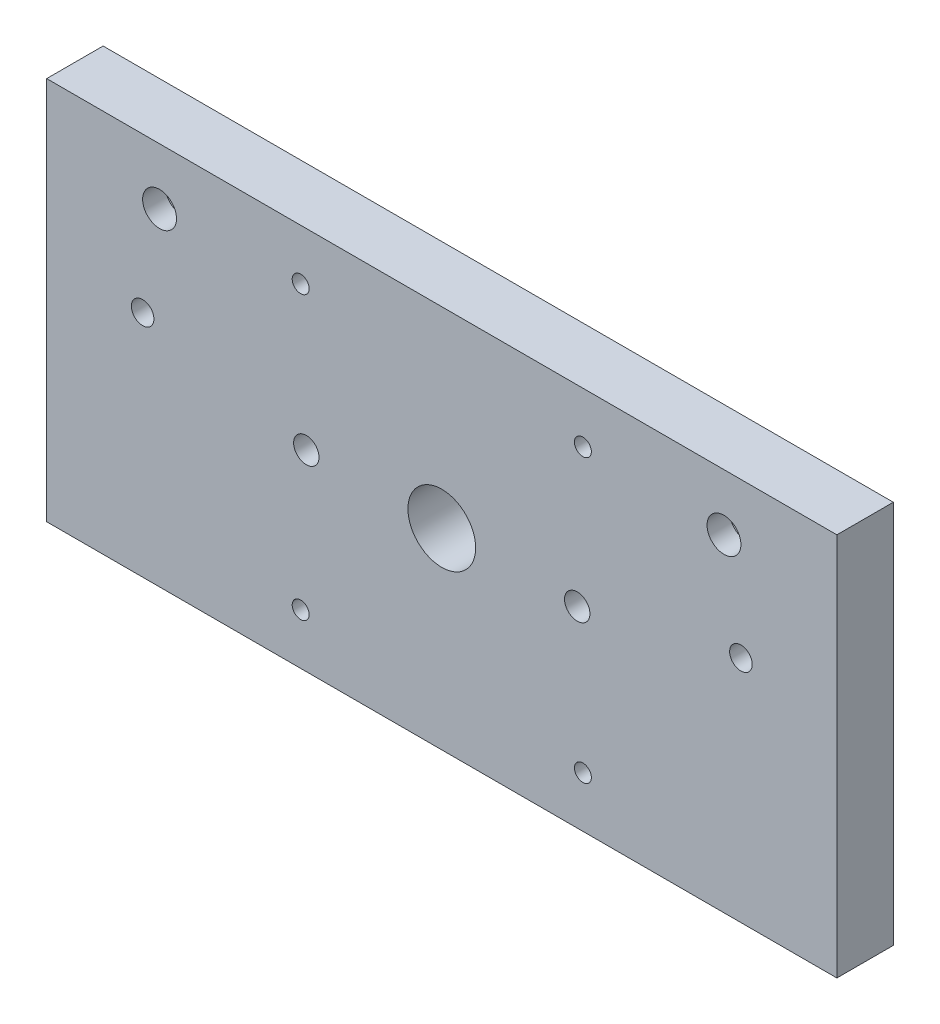
ISO-10303-21;
HEADER;
FILE_DESCRIPTION(('STEP AP214'),'2;1');
FILE_NAME('part.step','',(''),(''),'','','');
FILE_SCHEMA(('AUTOMOTIVE_DESIGN { 1 0 10303 214 1 1 1 1 }'));
ENDSEC;
DATA;
#1=APPLICATION_CONTEXT('core data for automotive mechanical design processes');
#2=APPLICATION_PROTOCOL_DEFINITION('international standard','automotive_design',2000,#1);
#3=PRODUCT_CONTEXT('',#1,'mechanical');
#4=PRODUCT('Part','Part','',(#3));
#5=PRODUCT_RELATED_PRODUCT_CATEGORY('part','',(#4));
#6=PRODUCT_DEFINITION_FORMATION('','',#4);
#7=PRODUCT_DEFINITION_CONTEXT('part definition',#1,'design');
#8=PRODUCT_DEFINITION('design','',#6,#7);
#9=PRODUCT_DEFINITION_SHAPE('','',#8);
#10=(LENGTH_UNIT() NAMED_UNIT(*) SI_UNIT(.MILLI.,.METRE.));
#11=(NAMED_UNIT(*) PLANE_ANGLE_UNIT() SI_UNIT($,.RADIAN.));
#12=(NAMED_UNIT(*) SI_UNIT($,.STERADIAN.) SOLID_ANGLE_UNIT());
#13=UNCERTAINTY_MEASURE_WITH_UNIT(LENGTH_MEASURE(1.E-05),#10,'distance_accuracy_value','');
#14=(GEOMETRIC_REPRESENTATION_CONTEXT(3) GLOBAL_UNCERTAINTY_ASSIGNED_CONTEXT((#13)) GLOBAL_UNIT_ASSIGNED_CONTEXT((#10,
#11,#12)) REPRESENTATION_CONTEXT('',''));
#15=CARTESIAN_POINT('',(0.,0.,0.));
#16=DIRECTION('',(0.,0.,1.));
#17=DIRECTION('',(1.,0.,0.));
#18=AXIS2_PLACEMENT_3D('',#15,#16,#17);
#19=CARTESIAN_POINT('',(17.,40.6,10.));
#20=DIRECTION('',(0.,0.,-1.));
#21=DIRECTION('',(-1.,0.,0.));
#22=AXIS2_PLACEMENT_3D('',#19,#20,#21);
#23=CYLINDRICAL_SURFACE('',#22,2.);
#24=CARTESIAN_POINT('',(17.,40.6,10.));
#25=DIRECTION('',(0.,0.,1.));
#26=DIRECTION('',(1.,0.,0.));
#27=AXIS2_PLACEMENT_3D('',#24,#25,#26);
#28=CIRCLE('',#27,2.);
#29=CARTESIAN_POINT('',(19.,40.6,10.));
#30=VERTEX_POINT('',#29);
#31=EDGE_CURVE('E171',#30,#30,#28,.T.);
#32=ORIENTED_EDGE('',*,*,#31,.T.);
#33=EDGE_LOOP('',(#32));
#34=FACE_BOUND('',#33,.T.);
#35=CARTESIAN_POINT('',(17.,40.6,4.));
#36=DIRECTION('',(0.,0.,-1.));
#37=DIRECTION('',(-1.,0.,0.));
#38=AXIS2_PLACEMENT_3D('',#35,#36,#37);
#39=CIRCLE('',#38,2.);
#40=CARTESIAN_POINT('',(15.,40.6,4.));
#41=VERTEX_POINT('',#40);
#42=EDGE_CURVE('E33',#41,#41,#39,.T.);
#43=ORIENTED_EDGE('',*,*,#42,.T.);
#44=EDGE_LOOP('',(#43));
#45=FACE_BOUND('',#44,.T.);
#46=ADVANCED_FACE('F29',(#34,#45),#23,.F.);
#47=CARTESIAN_POINT('',(123.,40.6,10.));
#48=DIRECTION('',(0.,0.,-1.));
#49=DIRECTION('',(-1.,0.,0.));
#50=AXIS2_PLACEMENT_3D('',#47,#48,#49);
#51=CYLINDRICAL_SURFACE('',#50,1.99999999999998);
#52=CARTESIAN_POINT('',(123.,40.6,10.));
#53=DIRECTION('',(0.,0.,1.));
#54=DIRECTION('',(1.,0.,0.));
#55=AXIS2_PLACEMENT_3D('',#52,#53,#54);
#56=CIRCLE('',#55,1.99999999999998);
#57=CARTESIAN_POINT('',(125.,40.6,10.));
#58=VERTEX_POINT('',#57);
#59=EDGE_CURVE('E174',#58,#58,#56,.T.);
#60=ORIENTED_EDGE('',*,*,#59,.T.);
#61=EDGE_LOOP('',(#60));
#62=FACE_BOUND('',#61,.T.);
#63=CARTESIAN_POINT('',(123.,40.6,4.));
#64=DIRECTION('',(0.,0.,-1.));
#65=DIRECTION('',(-1.,0.,0.));
#66=AXIS2_PLACEMENT_3D('',#63,#64,#65);
#67=CIRCLE('',#66,1.99999999999998);
#68=CARTESIAN_POINT('',(121.,40.6,4.));
#69=VERTEX_POINT('',#68);
#70=EDGE_CURVE('E119',#69,#69,#67,.T.);
#71=ORIENTED_EDGE('',*,*,#70,.T.);
#72=EDGE_LOOP('',(#71));
#73=FACE_BOUND('',#72,.T.);
#74=ADVANCED_FACE('F210',(#62,#73),#51,.F.);
#75=CARTESIAN_POINT('',(20.,58.,10.));
#76=DIRECTION('',(0.,0.,-1.));
#77=DIRECTION('',(-1.,0.,0.));
#78=AXIS2_PLACEMENT_3D('',#75,#76,#77);
#79=CYLINDRICAL_SURFACE('',#78,3.);
#80=CARTESIAN_POINT('',(20.,58.,10.));
#81=DIRECTION('',(0.,0.,-1.));
#82=DIRECTION('',(-1.,0.,0.));
#83=AXIS2_PLACEMENT_3D('',#80,#81,#82);
#84=CIRCLE('',#83,3.);
#85=CARTESIAN_POINT('',(17.,58.,10.));
#86=VERTEX_POINT('',#85);
#87=EDGE_CURVE('E159',#86,#86,#84,.T.);
#88=ORIENTED_EDGE('',*,*,#87,.F.);
#89=EDGE_LOOP('',(#88));
#90=FACE_BOUND('',#89,.T.);
#91=CARTESIAN_POINT('',(20.,58.,6.));
#92=DIRECTION('',(0.,0.,-1.));
#93=DIRECTION('',(-1.,0.,0.));
#94=AXIS2_PLACEMENT_3D('',#91,#92,#93);
#95=CIRCLE('',#94,3.);
#96=CARTESIAN_POINT('',(17.,58.,6.));
#97=VERTEX_POINT('',#96);
#98=EDGE_CURVE('E115',#97,#97,#95,.F.);
#99=ORIENTED_EDGE('',*,*,#98,.F.);
#100=EDGE_LOOP('',(#99));
#101=FACE_BOUND('',#100,.T.);
#102=ADVANCED_FACE('F217',(#90,#101),#79,.F.);
#103=CARTESIAN_POINT('',(120.,58.,10.));
#104=DIRECTION('',(0.,0.,-1.));
#105=DIRECTION('',(-1.,0.,0.));
#106=AXIS2_PLACEMENT_3D('',#103,#104,#105);
#107=CYLINDRICAL_SURFACE('',#106,3.00000000000001);
#108=CARTESIAN_POINT('',(120.,58.,10.));
#109=DIRECTION('',(0.,0.,-1.));
#110=DIRECTION('',(-1.,0.,0.));
#111=AXIS2_PLACEMENT_3D('',#108,#109,#110);
#112=CIRCLE('',#111,3.00000000000001);
#113=CARTESIAN_POINT('',(117.,58.,10.));
#114=VERTEX_POINT('',#113);
#115=EDGE_CURVE('E168',#114,#114,#112,.T.);
#116=ORIENTED_EDGE('',*,*,#115,.F.);
#117=EDGE_LOOP('',(#116));
#118=FACE_BOUND('',#117,.T.);
#119=CARTESIAN_POINT('',(120.,58.,6.));
#120=DIRECTION('',(0.,0.,-1.));
#121=DIRECTION('',(-1.,0.,0.));
#122=AXIS2_PLACEMENT_3D('',#119,#120,#121);
#123=CIRCLE('',#122,3.00000000000001);
#124=CARTESIAN_POINT('',(117.,58.,6.));
#125=VERTEX_POINT('',#124);
#126=EDGE_CURVE('E110',#125,#125,#123,.F.);
#127=ORIENTED_EDGE('',*,*,#126,.F.);
#128=EDGE_LOOP('',(#127));
#129=FACE_BOUND('',#128,.T.);
#130=ADVANCED_FACE('F222',(#118,#129),#107,.F.);
#131=CARTESIAN_POINT('',(0.,68.,10.));
#132=DIRECTION('',(0.,0.,-1.));
#133=DIRECTION('',(-1.,0.,0.));
#134=AXIS2_PLACEMENT_3D('',#131,#132,#133);
#135=PLANE('',#134);
#136=CARTESIAN_POINT('',(95.,9.00000000000746,10.));
#137=DIRECTION('',(0.,0.,-1.));
#138=DIRECTION('',(-1.,0.,0.));
#139=AXIS2_PLACEMENT_3D('',#136,#137,#138);
#140=CIRCLE('',#139,1.5);
#141=CARTESIAN_POINT('',(93.5,9.00000000000746,10.));
#142=VERTEX_POINT('',#141);
#143=EDGE_CURVE('E113',#142,#142,#140,.T.);
#144=ORIENTED_EDGE('',*,*,#143,.T.);
#145=EDGE_LOOP('',(#144));
#146=FACE_BOUND('',#145,.T.);
#147=CARTESIAN_POINT('',(45.,9.00000000000746,10.));
#148=DIRECTION('',(0.,0.,-1.));
#149=DIRECTION('',(-1.,0.,0.));
#150=AXIS2_PLACEMENT_3D('',#147,#148,#149);
#151=CIRCLE('',#150,1.5);
#152=CARTESIAN_POINT('',(43.5,9.00000000000746,10.));
#153=VERTEX_POINT('',#152);
#154=EDGE_CURVE('E147',#153,#153,#151,.T.);
#155=ORIENTED_EDGE('',*,*,#154,.T.);
#156=EDGE_LOOP('',(#155));
#157=FACE_BOUND('',#156,.T.);
#158=CARTESIAN_POINT('',(45.,59.0000000000075,10.));
#159=DIRECTION('',(0.,0.,-1.));
#160=DIRECTION('',(-1.,0.,0.));
#161=AXIS2_PLACEMENT_3D('',#158,#159,#160);
#162=CIRCLE('',#161,1.5);
#163=CARTESIAN_POINT('',(43.5,59.0000000000075,10.));
#164=VERTEX_POINT('',#163);
#165=EDGE_CURVE('E153',#164,#164,#162,.T.);
#166=ORIENTED_EDGE('',*,*,#165,.T.);
#167=EDGE_LOOP('',(#166));
#168=FACE_BOUND('',#167,.T.);
#169=ORIENTED_EDGE('',*,*,#87,.T.);
#170=EDGE_LOOP('',(#169));
#171=FACE_BOUND('',#170,.T.);
#172=CARTESIAN_POINT('',(95.,59.0000000000075,10.));
#173=DIRECTION('',(0.,0.,-1.));
#174=DIRECTION('',(-1.,0.,0.));
#175=AXIS2_PLACEMENT_3D('',#172,#173,#174);
#176=CIRCLE('',#175,1.5);
#177=CARTESIAN_POINT('',(93.5,59.0000000000075,10.));
#178=VERTEX_POINT('',#177);
#179=EDGE_CURVE('E162',#178,#178,#176,.T.);
#180=ORIENTED_EDGE('',*,*,#179,.T.);
#181=EDGE_LOOP('',(#180));
#182=FACE_BOUND('',#181,.T.);
#183=ORIENTED_EDGE('',*,*,#115,.T.);
#184=EDGE_LOOP('',(#183));
#185=FACE_BOUND('',#184,.T.);
#186=ORIENTED_EDGE('',*,*,#59,.F.);
#187=EDGE_LOOP('',(#186));
#188=FACE_BOUND('',#187,.T.);
#189=CARTESIAN_POINT('',(94.,33.9999999999924,10.));
#190=DIRECTION('',(0.,0.,1.));
#191=DIRECTION('',(1.,0.,0.));
#192=AXIS2_PLACEMENT_3D('',#189,#190,#191);
#193=CIRCLE('',#192,2.25);
#194=CARTESIAN_POINT('',(96.25,33.9999999999924,10.));
#195=VERTEX_POINT('',#194);
#196=EDGE_CURVE('E186',#195,#195,#193,.T.);
#197=ORIENTED_EDGE('',*,*,#196,.F.);
#198=EDGE_LOOP('',(#197));
#199=FACE_BOUND('',#198,.T.);
#200=DIRECTION('',(0.,-1.,0.));
#201=VECTOR('',#200,1.);
#202=CARTESIAN_POINT('',(0.,0.,10.));
#203=LINE('',#202,#201);
#204=CARTESIAN_POINT('',(0.,68.,10.));
#205=VERTEX_POINT('',#204);
#206=CARTESIAN_POINT('',(0.,0.,10.));
#207=VERTEX_POINT('',#206);
#208=EDGE_CURVE('E100',#205,#207,#203,.T.);
#209=ORIENTED_EDGE('',*,*,#208,.T.);
#210=DIRECTION('',(1.,0.,0.));
#211=VECTOR('',#210,1.);
#212=CARTESIAN_POINT('',(0.,0.,10.));
#213=LINE('',#212,#211);
#214=CARTESIAN_POINT('',(140.,0.,10.));
#215=VERTEX_POINT('',#214);
#216=EDGE_CURVE('E85',#207,#215,#213,.T.);
#217=ORIENTED_EDGE('',*,*,#216,.T.);
#218=DIRECTION('',(0.,1.,0.));
#219=VECTOR('',#218,1.);
#220=CARTESIAN_POINT('',(140.,0.,10.));
#221=LINE('',#220,#219);
#222=CARTESIAN_POINT('',(140.,68.,10.));
#223=VERTEX_POINT('',#222);
#224=EDGE_CURVE('E51',#215,#223,#221,.T.);
#225=ORIENTED_EDGE('',*,*,#224,.T.);
#226=DIRECTION('',(-1.,0.,0.));
#227=VECTOR('',#226,1.);
#228=CARTESIAN_POINT('',(0.,68.,10.));
#229=LINE('',#228,#227);
#230=EDGE_CURVE('E46',#223,#205,#229,.T.);
#231=ORIENTED_EDGE('',*,*,#230,.T.);
#232=EDGE_LOOP('',(#209,#217,#225,#231));
#233=FACE_BOUND('',#232,.T.);
#234=CARTESIAN_POINT('',(70.,33.9999999999925,10.));
#235=DIRECTION('',(0.,0.,1.));
#236=DIRECTION('',(1.,0.,0.));
#237=AXIS2_PLACEMENT_3D('',#234,#235,#236);
#238=CIRCLE('',#237,5.99999999999999);
#239=CARTESIAN_POINT('',(76.,33.9999999999925,10.));
#240=VERTEX_POINT('',#239);
#241=EDGE_CURVE('E90',#240,#240,#238,.T.);
#242=ORIENTED_EDGE('',*,*,#241,.F.);
#243=EDGE_LOOP('',(#242));
#244=FACE_BOUND('',#243,.T.);
#245=CARTESIAN_POINT('',(46.,33.9999999999926,10.));
#246=DIRECTION('',(0.,0.,1.));
#247=DIRECTION('',(1.,0.,0.));
#248=AXIS2_PLACEMENT_3D('',#245,#246,#247);
#249=CIRCLE('',#248,2.25);
#250=CARTESIAN_POINT('',(48.25,33.9999999999926,10.));
#251=VERTEX_POINT('',#250);
#252=EDGE_CURVE('E180',#251,#251,#249,.T.);
#253=ORIENTED_EDGE('',*,*,#252,.F.);
#254=EDGE_LOOP('',(#253));
#255=FACE_BOUND('',#254,.T.);
#256=ORIENTED_EDGE('',*,*,#31,.F.);
#257=EDGE_LOOP('',(#256));
#258=FACE_BOUND('',#257,.T.);
#259=ADVANCED_FACE('F238',(#146,#157,#168,#171,#182,#185,#188,#199,#233,#244,#255,#258),#135,.F.);
#260=CARTESIAN_POINT('',(0.,68.,0.));
#261=DIRECTION('',(0.,0.,-1.));
#262=DIRECTION('',(-1.,0.,0.));
#263=AXIS2_PLACEMENT_3D('',#260,#261,#262);
#264=PLANE('',#263);
#265=CARTESIAN_POINT('',(17.,40.6,0.));
#266=DIRECTION('',(0.,0.,-1.));
#267=DIRECTION('',(-1.,0.,0.));
#268=AXIS2_PLACEMENT_3D('',#265,#266,#267);
#269=CIRCLE('',#268,3.50000000000001);
#270=CARTESIAN_POINT('',(13.5,40.6,0.));
#271=VERTEX_POINT('',#270);
#272=EDGE_CURVE('E388',#271,#271,#269,.T.);
#273=ORIENTED_EDGE('',*,*,#272,.F.);
#274=EDGE_LOOP('',(#273));
#275=FACE_BOUND('',#274,.T.);
#276=CARTESIAN_POINT('',(123.,40.6,0.));
#277=DIRECTION('',(0.,0.,-1.));
#278=DIRECTION('',(-1.,0.,0.));
#279=AXIS2_PLACEMENT_3D('',#276,#277,#278);
#280=CIRCLE('',#279,3.49999999999999);
#281=CARTESIAN_POINT('',(119.5,40.6,0.));
#282=VERTEX_POINT('',#281);
#283=EDGE_CURVE('E128',#282,#282,#280,.T.);
#284=ORIENTED_EDGE('',*,*,#283,.F.);
#285=EDGE_LOOP('',(#284));
#286=FACE_BOUND('',#285,.T.);
#287=CARTESIAN_POINT('',(20.,58.,0.));
#288=DIRECTION('',(0.,0.,-1.));
#289=DIRECTION('',(-1.,0.,0.));
#290=AXIS2_PLACEMENT_3D('',#287,#288,#289);
#291=CIRCLE('',#290,5.);
#292=CARTESIAN_POINT('',(15.,58.,0.));
#293=VERTEX_POINT('',#292);
#294=EDGE_CURVE('E121',#293,#293,#291,.T.);
#295=ORIENTED_EDGE('',*,*,#294,.F.);
#296=EDGE_LOOP('',(#295));
#297=FACE_BOUND('',#296,.T.);
#298=CARTESIAN_POINT('',(120.,58.,0.));
#299=DIRECTION('',(0.,0.,-1.));
#300=DIRECTION('',(-1.,0.,0.));
#301=AXIS2_PLACEMENT_3D('',#298,#299,#300);
#302=CIRCLE('',#301,5.00000000000001);
#303=CARTESIAN_POINT('',(115.,58.,0.));
#304=VERTEX_POINT('',#303);
#305=EDGE_CURVE('E117',#304,#304,#302,.T.);
#306=ORIENTED_EDGE('',*,*,#305,.F.);
#307=EDGE_LOOP('',(#306));
#308=FACE_BOUND('',#307,.T.);
#309=CARTESIAN_POINT('',(95.,9.00000000000746,0.));
#310=DIRECTION('',(0.,0.,-1.));
#311=DIRECTION('',(-1.,0.,0.));
#312=AXIS2_PLACEMENT_3D('',#309,#310,#311);
#313=CIRCLE('',#312,1.5);
#314=CARTESIAN_POINT('',(93.5,9.00000000000746,0.));
#315=VERTEX_POINT('',#314);
#316=EDGE_CURVE('E144',#315,#315,#313,.T.);
#317=ORIENTED_EDGE('',*,*,#316,.F.);
#318=EDGE_LOOP('',(#317));
#319=FACE_BOUND('',#318,.T.);
#320=CARTESIAN_POINT('',(45.,9.00000000000746,0.));
#321=DIRECTION('',(0.,0.,-1.));
#322=DIRECTION('',(-1.,0.,0.));
#323=AXIS2_PLACEMENT_3D('',#320,#321,#322);
#324=CIRCLE('',#323,1.5);
#325=CARTESIAN_POINT('',(43.5,9.00000000000746,0.));
#326=VERTEX_POINT('',#325);
#327=EDGE_CURVE('E150',#326,#326,#324,.T.);
#328=ORIENTED_EDGE('',*,*,#327,.F.);
#329=EDGE_LOOP('',(#328));
#330=FACE_BOUND('',#329,.T.);
#331=CARTESIAN_POINT('',(45.,59.0000000000075,0.));
#332=DIRECTION('',(0.,0.,-1.));
#333=DIRECTION('',(-1.,0.,0.));
#334=AXIS2_PLACEMENT_3D('',#331,#332,#333);
#335=CIRCLE('',#334,1.5);
#336=CARTESIAN_POINT('',(43.5,59.0000000000075,0.));
#337=VERTEX_POINT('',#336);
#338=EDGE_CURVE('E156',#337,#337,#335,.T.);
#339=ORIENTED_EDGE('',*,*,#338,.F.);
#340=EDGE_LOOP('',(#339));
#341=FACE_BOUND('',#340,.T.);
#342=CARTESIAN_POINT('',(95.,59.0000000000075,0.));
#343=DIRECTION('',(0.,0.,-1.));
#344=DIRECTION('',(-1.,0.,0.));
#345=AXIS2_PLACEMENT_3D('',#342,#343,#344);
#346=CIRCLE('',#345,1.5);
#347=CARTESIAN_POINT('',(93.5,59.0000000000075,0.));
#348=VERTEX_POINT('',#347);
#349=EDGE_CURVE('E165',#348,#348,#346,.T.);
#350=ORIENTED_EDGE('',*,*,#349,.F.);
#351=EDGE_LOOP('',(#350));
#352=FACE_BOUND('',#351,.T.);
#353=CARTESIAN_POINT('',(94.,33.9999999999924,0.));
#354=DIRECTION('',(0.,0.,1.));
#355=DIRECTION('',(1.,0.,0.));
#356=AXIS2_PLACEMENT_3D('',#353,#354,#355);
#357=CIRCLE('',#356,2.25);
#358=CARTESIAN_POINT('',(96.25,33.9999999999924,0.));
#359=VERTEX_POINT('',#358);
#360=EDGE_CURVE('E183',#359,#359,#357,.T.);
#361=ORIENTED_EDGE('',*,*,#360,.T.);
#362=EDGE_LOOP('',(#361));
#363=FACE_BOUND('',#362,.T.);
#364=DIRECTION('',(0.,-1.,0.));
#365=VECTOR('',#364,1.);
#366=CARTESIAN_POINT('',(0.,0.,0.));
#367=LINE('',#366,#365);
#368=CARTESIAN_POINT('',(0.,68.,0.));
#369=VERTEX_POINT('',#368);
#370=CARTESIAN_POINT('',(0.,0.,0.));
#371=VERTEX_POINT('',#370);
#372=EDGE_CURVE('E77',#369,#371,#367,.T.);
#373=ORIENTED_EDGE('',*,*,#372,.F.);
#374=DIRECTION('',(-1.,0.,0.));
#375=VECTOR('',#374,1.);
#376=CARTESIAN_POINT('',(0.,68.,0.));
#377=LINE('',#376,#375);
#378=CARTESIAN_POINT('',(140.,68.,0.));
#379=VERTEX_POINT('',#378);
#380=EDGE_CURVE('E98',#379,#369,#377,.T.);
#381=ORIENTED_EDGE('',*,*,#380,.F.);
#382=DIRECTION('',(0.,1.,0.));
#383=VECTOR('',#382,1.);
#384=CARTESIAN_POINT('',(140.,0.,0.));
#385=LINE('',#384,#383);
#386=CARTESIAN_POINT('',(140.,0.,0.));
#387=VERTEX_POINT('',#386);
#388=EDGE_CURVE('E78',#387,#379,#385,.T.);
#389=ORIENTED_EDGE('',*,*,#388,.F.);
#390=DIRECTION('',(1.,0.,0.));
#391=VECTOR('',#390,1.);
#392=CARTESIAN_POINT('',(0.,0.,0.));
#393=LINE('',#392,#391);
#394=EDGE_CURVE('E72',#371,#387,#393,.T.);
#395=ORIENTED_EDGE('',*,*,#394,.F.);
#396=EDGE_LOOP('',(#373,#381,#389,#395));
#397=FACE_BOUND('',#396,.T.);
#398=CARTESIAN_POINT('',(70.,33.9999999999925,0.));
#399=DIRECTION('',(0.,0.,1.));
#400=DIRECTION('',(1.,0.,0.));
#401=AXIS2_PLACEMENT_3D('',#398,#399,#400);
#402=CIRCLE('',#401,5.99999999999999);
#403=CARTESIAN_POINT('',(76.,33.9999999999925,0.));
#404=VERTEX_POINT('',#403);
#405=EDGE_CURVE('E93',#404,#404,#402,.T.);
#406=ORIENTED_EDGE('',*,*,#405,.T.);
#407=EDGE_LOOP('',(#406));
#408=FACE_BOUND('',#407,.T.);
#409=CARTESIAN_POINT('',(46.,33.9999999999926,0.));
#410=DIRECTION('',(0.,0.,1.));
#411=DIRECTION('',(1.,0.,0.));
#412=AXIS2_PLACEMENT_3D('',#409,#410,#411);
#413=CIRCLE('',#412,2.25);
#414=CARTESIAN_POINT('',(48.25,33.9999999999926,0.));
#415=VERTEX_POINT('',#414);
#416=EDGE_CURVE('E177',#415,#415,#413,.T.);
#417=ORIENTED_EDGE('',*,*,#416,.T.);
#418=EDGE_LOOP('',(#417));
#419=FACE_BOUND('',#418,.T.);
#420=ADVANCED_FACE('F73',(#275,#286,#297,#308,#319,#330,#341,#352,#363,#397,#408,#419),#264,.T.);
#421=CARTESIAN_POINT('',(0.,0.,10.));
#422=DIRECTION('',(1.,0.,0.));
#423=DIRECTION('',(0.,0.,-1.));
#424=AXIS2_PLACEMENT_3D('',#421,#422,#423);
#425=PLANE('',#424);
#426=ORIENTED_EDGE('',*,*,#372,.T.);
#427=DIRECTION('',(0.,0.,-1.));
#428=VECTOR('',#427,1.);
#429=CARTESIAN_POINT('',(0.,0.,10.));
#430=LINE('',#429,#428);
#431=EDGE_CURVE('E11',#207,#371,#430,.T.);
#432=ORIENTED_EDGE('',*,*,#431,.F.);
#433=ORIENTED_EDGE('',*,*,#208,.F.);
#434=DIRECTION('',(0.,0.,-1.));
#435=VECTOR('',#434,1.);
#436=CARTESIAN_POINT('',(0.,68.,10.));
#437=LINE('',#436,#435);
#438=EDGE_CURVE('E89',#205,#369,#437,.T.);
#439=ORIENTED_EDGE('',*,*,#438,.T.);
#440=EDGE_LOOP('',(#426,#432,#433,#439));
#441=FACE_BOUND('',#440,.T.);
#442=ADVANCED_FACE('F31',(#441),#425,.F.);
#443=CARTESIAN_POINT('',(0.,0.,10.));
#444=DIRECTION('',(0.,1.,0.));
#445=DIRECTION('',(0.,0.,1.));
#446=AXIS2_PLACEMENT_3D('',#443,#444,#445);
#447=PLANE('',#446);
#448=ORIENTED_EDGE('',*,*,#394,.T.);
#449=DIRECTION('',(0.,0.,-1.));
#450=VECTOR('',#449,1.);
#451=CARTESIAN_POINT('',(140.,0.,10.));
#452=LINE('',#451,#450);
#453=EDGE_CURVE('E38',#215,#387,#452,.T.);
#454=ORIENTED_EDGE('',*,*,#453,.F.);
#455=ORIENTED_EDGE('',*,*,#216,.F.);
#456=ORIENTED_EDGE('',*,*,#431,.T.);
#457=EDGE_LOOP('',(#448,#454,#455,#456));
#458=FACE_BOUND('',#457,.T.);
#459=ADVANCED_FACE('F84',(#458),#447,.F.);
#460=CARTESIAN_POINT('',(140.,0.,10.));
#461=DIRECTION('',(-1.,0.,0.));
#462=DIRECTION('',(0.,0.,1.));
#463=AXIS2_PLACEMENT_3D('',#460,#461,#462);
#464=PLANE('',#463);
#465=ORIENTED_EDGE('',*,*,#388,.T.);
#466=DIRECTION('',(0.,0.,-1.));
#467=VECTOR('',#466,1.);
#468=CARTESIAN_POINT('',(140.,68.,10.));
#469=LINE('',#468,#467);
#470=EDGE_CURVE('E106',#223,#379,#469,.T.);
#471=ORIENTED_EDGE('',*,*,#470,.F.);
#472=ORIENTED_EDGE('',*,*,#224,.F.);
#473=ORIENTED_EDGE('',*,*,#453,.T.);
#474=EDGE_LOOP('',(#465,#471,#472,#473));
#475=FACE_BOUND('',#474,.T.);
#476=ADVANCED_FACE('F205',(#475),#464,.F.);
#477=CARTESIAN_POINT('',(0.,68.,10.));
#478=DIRECTION('',(0.,-1.,0.));
#479=DIRECTION('',(0.,0.,-1.));
#480=AXIS2_PLACEMENT_3D('',#477,#478,#479);
#481=PLANE('',#480);
#482=ORIENTED_EDGE('',*,*,#380,.T.);
#483=ORIENTED_EDGE('',*,*,#438,.F.);
#484=ORIENTED_EDGE('',*,*,#230,.F.);
#485=ORIENTED_EDGE('',*,*,#470,.T.);
#486=EDGE_LOOP('',(#482,#483,#484,#485));
#487=FACE_BOUND('',#486,.T.);
#488=ADVANCED_FACE('F195',(#487),#481,.F.);
#489=CARTESIAN_POINT('',(70.,33.9999999999925,10.));
#490=DIRECTION('',(0.,0.,-1.));
#491=DIRECTION('',(-1.,0.,0.));
#492=AXIS2_PLACEMENT_3D('',#489,#490,#491);
#493=CYLINDRICAL_SURFACE('',#492,5.99999999999999);
#494=ORIENTED_EDGE('',*,*,#241,.T.);
#495=EDGE_LOOP('',(#494));
#496=FACE_BOUND('',#495,.T.);
#497=ORIENTED_EDGE('',*,*,#405,.F.);
#498=EDGE_LOOP('',(#497));
#499=FACE_BOUND('',#498,.T.);
#500=ADVANCED_FACE('F192',(#496,#499),#493,.F.);
#501=CARTESIAN_POINT('',(94.,33.9999999999924,10.));
#502=DIRECTION('',(0.,0.,-1.));
#503=DIRECTION('',(-1.,0.,0.));
#504=AXIS2_PLACEMENT_3D('',#501,#502,#503);
#505=CYLINDRICAL_SURFACE('',#504,2.25);
#506=ORIENTED_EDGE('',*,*,#196,.T.);
#507=EDGE_LOOP('',(#506));
#508=FACE_BOUND('',#507,.T.);
#509=ORIENTED_EDGE('',*,*,#360,.F.);
#510=EDGE_LOOP('',(#509));
#511=FACE_BOUND('',#510,.T.);
#512=ADVANCED_FACE('F194',(#508,#511),#505,.F.);
#513=CARTESIAN_POINT('',(46.,33.9999999999926,10.));
#514=DIRECTION('',(0.,0.,-1.));
#515=DIRECTION('',(-1.,0.,0.));
#516=AXIS2_PLACEMENT_3D('',#513,#514,#515);
#517=CYLINDRICAL_SURFACE('',#516,2.25);
#518=ORIENTED_EDGE('',*,*,#252,.T.);
#519=EDGE_LOOP('',(#518));
#520=FACE_BOUND('',#519,.T.);
#521=ORIENTED_EDGE('',*,*,#416,.F.);
#522=EDGE_LOOP('',(#521));
#523=FACE_BOUND('',#522,.T.);
#524=ADVANCED_FACE('F202',(#520,#523),#517,.F.);
#525=CARTESIAN_POINT('',(95.,59.0000000000075,10.));
#526=DIRECTION('',(0.,0.,-1.));
#527=DIRECTION('',(-1.,0.,0.));
#528=AXIS2_PLACEMENT_3D('',#525,#526,#527);
#529=CYLINDRICAL_SURFACE('',#528,1.5);
#530=ORIENTED_EDGE('',*,*,#179,.F.);
#531=EDGE_LOOP('',(#530));
#532=FACE_BOUND('',#531,.T.);
#533=ORIENTED_EDGE('',*,*,#349,.T.);
#534=EDGE_LOOP('',(#533));
#535=FACE_BOUND('',#534,.T.);
#536=ADVANCED_FACE('F226',(#532,#535),#529,.F.);
#537=CARTESIAN_POINT('',(45.,59.0000000000075,10.));
#538=DIRECTION('',(0.,0.,-1.));
#539=DIRECTION('',(-1.,0.,0.));
#540=AXIS2_PLACEMENT_3D('',#537,#538,#539);
#541=CYLINDRICAL_SURFACE('',#540,1.5);
#542=ORIENTED_EDGE('',*,*,#165,.F.);
#543=EDGE_LOOP('',(#542));
#544=FACE_BOUND('',#543,.T.);
#545=ORIENTED_EDGE('',*,*,#338,.T.);
#546=EDGE_LOOP('',(#545));
#547=FACE_BOUND('',#546,.T.);
#548=ADVANCED_FACE('F232',(#544,#547),#541,.F.);
#549=CARTESIAN_POINT('',(45.,9.00000000000746,10.));
#550=DIRECTION('',(0.,0.,-1.));
#551=DIRECTION('',(-1.,0.,0.));
#552=AXIS2_PLACEMENT_3D('',#549,#550,#551);
#553=CYLINDRICAL_SURFACE('',#552,1.5);
#554=ORIENTED_EDGE('',*,*,#154,.F.);
#555=EDGE_LOOP('',(#554));
#556=FACE_BOUND('',#555,.T.);
#557=ORIENTED_EDGE('',*,*,#327,.T.);
#558=EDGE_LOOP('',(#557));
#559=FACE_BOUND('',#558,.T.);
#560=ADVANCED_FACE('F283',(#556,#559),#553,.F.);
#561=CARTESIAN_POINT('',(95.,9.00000000000746,10.));
#562=DIRECTION('',(0.,0.,-1.));
#563=DIRECTION('',(-1.,0.,0.));
#564=AXIS2_PLACEMENT_3D('',#561,#562,#563);
#565=CYLINDRICAL_SURFACE('',#564,1.5);
#566=ORIENTED_EDGE('',*,*,#143,.F.);
#567=EDGE_LOOP('',(#566));
#568=FACE_BOUND('',#567,.T.);
#569=ORIENTED_EDGE('',*,*,#316,.T.);
#570=EDGE_LOOP('',(#569));
#571=FACE_BOUND('',#570,.T.);
#572=ADVANCED_FACE('F291',(#568,#571),#565,.F.);
#573=CARTESIAN_POINT('',(120.,58.,6.));
#574=DIRECTION('',(0.,0.,-1.));
#575=DIRECTION('',(-1.,0.,0.));
#576=AXIS2_PLACEMENT_3D('',#573,#574,#575);
#577=PLANE('',#576);
#578=CARTESIAN_POINT('',(120.,58.,6.));
#579=DIRECTION('',(0.,0.,-1.));
#580=DIRECTION('',(-1.,0.,0.));
#581=AXIS2_PLACEMENT_3D('',#578,#579,#580);
#582=CIRCLE('',#581,5.00000000000001);
#583=CARTESIAN_POINT('',(115.,58.,6.));
#584=VERTEX_POINT('',#583);
#585=EDGE_CURVE('E114',#584,#584,#582,.T.);
#586=ORIENTED_EDGE('',*,*,#585,.T.);
#587=EDGE_LOOP('',(#586));
#588=FACE_BOUND('',#587,.T.);
#589=ORIENTED_EDGE('',*,*,#126,.T.);
#590=EDGE_LOOP('',(#589));
#591=FACE_BOUND('',#590,.T.);
#592=ADVANCED_FACE('F299',(#588,#591),#577,.T.);
#593=CARTESIAN_POINT('',(120.,58.,6.));
#594=DIRECTION('',(0.,0.,-1.));
#595=DIRECTION('',(-1.,0.,0.));
#596=AXIS2_PLACEMENT_3D('',#593,#594,#595);
#597=CYLINDRICAL_SURFACE('',#596,5.00000000000001);
#598=ORIENTED_EDGE('',*,*,#585,.F.);
#599=EDGE_LOOP('',(#598));
#600=FACE_BOUND('',#599,.T.);
#601=ORIENTED_EDGE('',*,*,#305,.T.);
#602=EDGE_LOOP('',(#601));
#603=FACE_BOUND('',#602,.T.);
#604=ADVANCED_FACE('F320',(#600,#603),#597,.F.);
#605=CARTESIAN_POINT('',(20.,58.,6.));
#606=DIRECTION('',(0.,0.,-1.));
#607=DIRECTION('',(-1.,0.,0.));
#608=AXIS2_PLACEMENT_3D('',#605,#606,#607);
#609=PLANE('',#608);
#610=CARTESIAN_POINT('',(20.,58.,6.));
#611=DIRECTION('',(0.,0.,-1.));
#612=DIRECTION('',(-1.,0.,0.));
#613=AXIS2_PLACEMENT_3D('',#610,#611,#612);
#614=CIRCLE('',#613,5.);
#615=CARTESIAN_POINT('',(15.,58.,6.));
#616=VERTEX_POINT('',#615);
#617=EDGE_CURVE('E118',#616,#616,#614,.T.);
#618=ORIENTED_EDGE('',*,*,#617,.T.);
#619=EDGE_LOOP('',(#618));
#620=FACE_BOUND('',#619,.T.);
#621=ORIENTED_EDGE('',*,*,#98,.T.);
#622=EDGE_LOOP('',(#621));
#623=FACE_BOUND('',#622,.T.);
#624=ADVANCED_FACE('F328',(#620,#623),#609,.T.);
#625=CARTESIAN_POINT('',(20.,58.,6.));
#626=DIRECTION('',(0.,0.,-1.));
#627=DIRECTION('',(-1.,0.,0.));
#628=AXIS2_PLACEMENT_3D('',#625,#626,#627);
#629=CYLINDRICAL_SURFACE('',#628,5.);
#630=ORIENTED_EDGE('',*,*,#617,.F.);
#631=EDGE_LOOP('',(#630));
#632=FACE_BOUND('',#631,.T.);
#633=ORIENTED_EDGE('',*,*,#294,.T.);
#634=EDGE_LOOP('',(#633));
#635=FACE_BOUND('',#634,.T.);
#636=ADVANCED_FACE('F336',(#632,#635),#629,.F.);
#637=CARTESIAN_POINT('',(123.,40.6,4.));
#638=DIRECTION('',(0.,0.,-1.));
#639=DIRECTION('',(-1.,0.,0.));
#640=AXIS2_PLACEMENT_3D('',#637,#638,#639);
#641=CYLINDRICAL_SURFACE('',#640,3.49999999999999);
#642=CARTESIAN_POINT('',(123.,40.6,4.));
#643=DIRECTION('',(0.,0.,-1.));
#644=DIRECTION('',(-1.,0.,0.));
#645=AXIS2_PLACEMENT_3D('',#642,#643,#644);
#646=CIRCLE('',#645,3.49999999999999);
#647=CARTESIAN_POINT('',(119.5,40.6,4.));
#648=VERTEX_POINT('',#647);
#649=EDGE_CURVE('E122',#648,#648,#646,.T.);
#650=ORIENTED_EDGE('',*,*,#649,.F.);
#651=EDGE_LOOP('',(#650));
#652=FACE_BOUND('',#651,.T.);
#653=ORIENTED_EDGE('',*,*,#283,.T.);
#654=EDGE_LOOP('',(#653));
#655=FACE_BOUND('',#654,.T.);
#656=ADVANCED_FACE('F343',(#652,#655),#641,.F.);
#657=CARTESIAN_POINT('',(123.,40.6,4.));
#658=DIRECTION('',(0.,0.,-1.));
#659=DIRECTION('',(-1.,0.,0.));
#660=AXIS2_PLACEMENT_3D('',#657,#658,#659);
#661=PLANE('',#660);
#662=ORIENTED_EDGE('',*,*,#70,.F.);
#663=EDGE_LOOP('',(#662));
#664=FACE_BOUND('',#663,.T.);
#665=ORIENTED_EDGE('',*,*,#649,.T.);
#666=EDGE_LOOP('',(#665));
#667=FACE_BOUND('',#666,.T.);
#668=ADVANCED_FACE('F356',(#664,#667),#661,.T.);
#669=CARTESIAN_POINT('',(17.,40.6,4.));
#670=DIRECTION('',(0.,0.,-1.));
#671=DIRECTION('',(-1.,0.,0.));
#672=AXIS2_PLACEMENT_3D('',#669,#670,#671);
#673=CYLINDRICAL_SURFACE('',#672,3.50000000000001);
#674=CARTESIAN_POINT('',(17.,40.6,4.));
#675=DIRECTION('',(0.,0.,-1.));
#676=DIRECTION('',(-1.,0.,0.));
#677=AXIS2_PLACEMENT_3D('',#674,#675,#676);
#678=CIRCLE('',#677,3.50000000000001);
#679=CARTESIAN_POINT('',(13.5,40.6,4.));
#680=VERTEX_POINT('',#679);
#681=EDGE_CURVE('E387',#680,#680,#678,.T.);
#682=ORIENTED_EDGE('',*,*,#681,.F.);
#683=EDGE_LOOP('',(#682));
#684=FACE_BOUND('',#683,.T.);
#685=ORIENTED_EDGE('',*,*,#272,.T.);
#686=EDGE_LOOP('',(#685));
#687=FACE_BOUND('',#686,.T.);
#688=ADVANCED_FACE('F364',(#684,#687),#673,.F.);
#689=CARTESIAN_POINT('',(17.,40.6,4.));
#690=DIRECTION('',(0.,0.,-1.));
#691=DIRECTION('',(-1.,0.,0.));
#692=AXIS2_PLACEMENT_3D('',#689,#690,#691);
#693=PLANE('',#692);
#694=ORIENTED_EDGE('',*,*,#42,.F.);
#695=EDGE_LOOP('',(#694));
#696=FACE_BOUND('',#695,.T.);
#697=ORIENTED_EDGE('',*,*,#681,.T.);
#698=EDGE_LOOP('',(#697));
#699=FACE_BOUND('',#698,.T.);
#700=ADVANCED_FACE('F372',(#696,#699),#693,.T.);
#701=CLOSED_SHELL('',(#46,#74,#102,#130,#259,#420,#442,#459,#476,#488,#500,#512,#524,#536,#548,
#560,#572,#592,#604,#624,#636,#656,#668,#688,#700));
#702=MANIFOLD_SOLID_BREP('B2',#701);
#703=ADVANCED_BREP_SHAPE_REPRESENTATION('',(#18,#702),#14);
#704=SHAPE_DEFINITION_REPRESENTATION(#9,#703);
ENDSEC;
END-ISO-10303-21;
